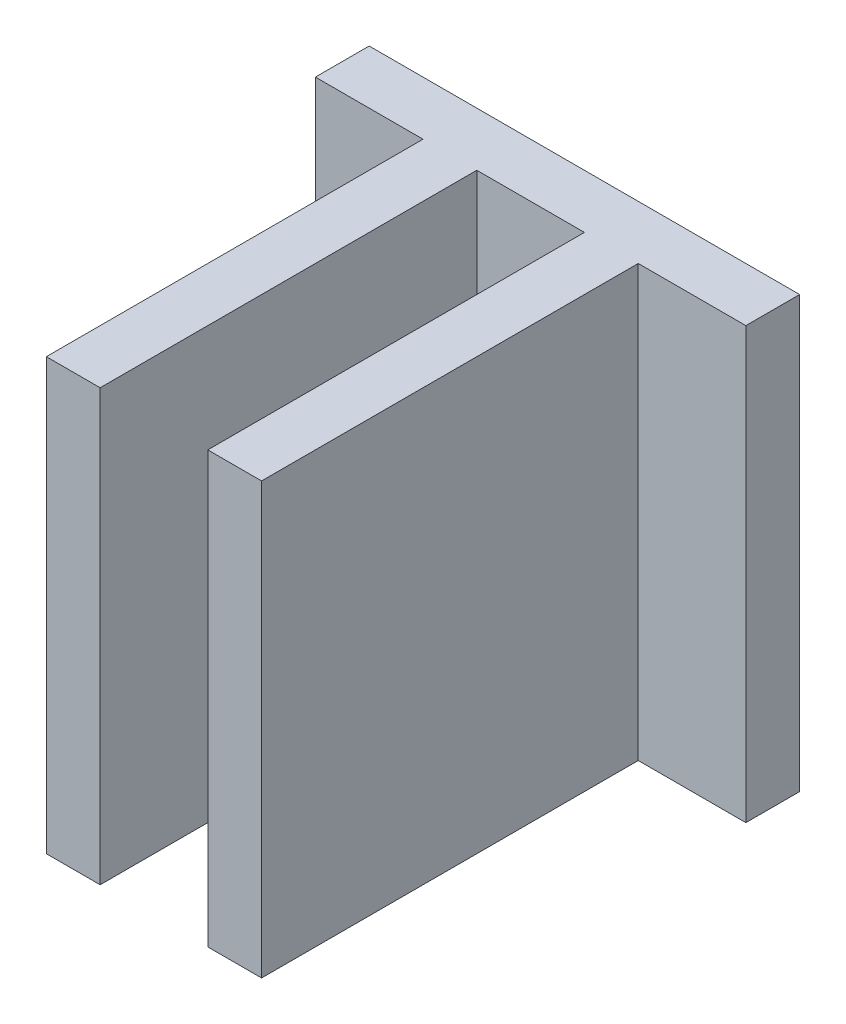
ISO-10303-21;
HEADER;
FILE_DESCRIPTION(('STEP AP214'),'2;1');
FILE_NAME('part.step','',(''),(''),'','','');
FILE_SCHEMA(('AUTOMOTIVE_DESIGN { 1 0 10303 214 1 1 1 1 }'));
ENDSEC;
DATA;
#1=APPLICATION_CONTEXT('core data for automotive mechanical design processes');
#2=APPLICATION_PROTOCOL_DEFINITION('international standard','automotive_design',2000,#1);
#3=PRODUCT_CONTEXT('',#1,'mechanical');
#4=PRODUCT('Part','Part','',(#3));
#5=PRODUCT_RELATED_PRODUCT_CATEGORY('part','',(#4));
#6=PRODUCT_DEFINITION_FORMATION('','',#4);
#7=PRODUCT_DEFINITION_CONTEXT('part definition',#1,'design');
#8=PRODUCT_DEFINITION('design','',#6,#7);
#9=PRODUCT_DEFINITION_SHAPE('','',#8);
#10=(LENGTH_UNIT() NAMED_UNIT(*) SI_UNIT(.MILLI.,.METRE.));
#11=(NAMED_UNIT(*) PLANE_ANGLE_UNIT() SI_UNIT($,.RADIAN.));
#12=(NAMED_UNIT(*) SI_UNIT($,.STERADIAN.) SOLID_ANGLE_UNIT());
#13=UNCERTAINTY_MEASURE_WITH_UNIT(LENGTH_MEASURE(1.E-05),#10,'distance_accuracy_value','');
#14=(GEOMETRIC_REPRESENTATION_CONTEXT(3) GLOBAL_UNCERTAINTY_ASSIGNED_CONTEXT((#13)) GLOBAL_UNIT_ASSIGNED_CONTEXT((#10,
#11,#12)) REPRESENTATION_CONTEXT('',''));
#15=CARTESIAN_POINT('',(0.,0.,0.));
#16=DIRECTION('',(0.,0.,1.));
#17=DIRECTION('',(1.,0.,0.));
#18=AXIS2_PLACEMENT_3D('',#15,#16,#17);
#19=CARTESIAN_POINT('',(0.,25.4,3.175));
#20=DIRECTION('',(1.,0.,0.));
#21=DIRECTION('',(0.,0.,-1.));
#22=AXIS2_PLACEMENT_3D('',#19,#20,#21);
#23=PLANE('',#22);
#24=DIRECTION('',(0.,0.,1.));
#25=VECTOR('',#24,1.);
#26=CARTESIAN_POINT('',(0.,0.,3.175));
#27=LINE('',#26,#25);
#28=CARTESIAN_POINT('',(0.,0.,0.));
#29=VERTEX_POINT('',#28);
#30=CARTESIAN_POINT('',(0.,0.,3.175));
#31=VERTEX_POINT('',#30);
#32=EDGE_CURVE('E153',#29,#31,#27,.T.);
#33=ORIENTED_EDGE('',*,*,#32,.T.);
#34=DIRECTION('',(0.,-1.,0.));
#35=VECTOR('',#34,1.);
#36=CARTESIAN_POINT('',(0.,25.4,3.175));
#37=LINE('',#36,#35);
#38=CARTESIAN_POINT('',(0.,25.4,3.175));
#39=VERTEX_POINT('',#38);
#40=EDGE_CURVE('E11',#39,#31,#37,.T.);
#41=ORIENTED_EDGE('',*,*,#40,.F.);
#42=DIRECTION('',(0.,0.,1.));
#43=VECTOR('',#42,1.);
#44=CARTESIAN_POINT('',(0.,25.4,3.175));
#45=LINE('',#44,#43);
#46=CARTESIAN_POINT('',(0.,25.4,0.));
#47=VERTEX_POINT('',#46);
#48=EDGE_CURVE('E175',#47,#39,#45,.T.);
#49=ORIENTED_EDGE('',*,*,#48,.F.);
#50=DIRECTION('',(0.,-1.,0.));
#51=VECTOR('',#50,1.);
#52=CARTESIAN_POINT('',(0.,25.4,0.));
#53=LINE('',#52,#51);
#54=EDGE_CURVE('E149',#47,#29,#53,.T.);
#55=ORIENTED_EDGE('',*,*,#54,.T.);
#56=EDGE_LOOP('',(#33,#41,#49,#55));
#57=FACE_BOUND('',#56,.T.);
#58=ADVANCED_FACE('F33',(#57),#23,.F.);
#59=CARTESIAN_POINT('',(6.35,25.4,3.175));
#60=DIRECTION('',(0.,0.,-1.));
#61=DIRECTION('',(-1.,0.,0.));
#62=AXIS2_PLACEMENT_3D('',#59,#60,#61);
#63=PLANE('',#62);
#64=DIRECTION('',(1.,0.,0.));
#65=VECTOR('',#64,1.);
#66=CARTESIAN_POINT('',(6.35,0.,3.175));
#67=LINE('',#66,#65);
#68=CARTESIAN_POINT('',(6.35,0.,3.175));
#69=VERTEX_POINT('',#68);
#70=EDGE_CURVE('E156',#31,#69,#67,.T.);
#71=ORIENTED_EDGE('',*,*,#70,.T.);
#72=DIRECTION('',(0.,-1.,0.));
#73=VECTOR('',#72,1.);
#74=CARTESIAN_POINT('',(6.35,25.4,3.175));
#75=LINE('',#74,#73);
#76=CARTESIAN_POINT('',(6.35,25.4,3.175));
#77=VERTEX_POINT('',#76);
#78=EDGE_CURVE('E41',#77,#69,#75,.T.);
#79=ORIENTED_EDGE('',*,*,#78,.F.);
#80=DIRECTION('',(1.,0.,0.));
#81=VECTOR('',#80,1.);
#82=CARTESIAN_POINT('',(6.35,25.4,3.175));
#83=LINE('',#82,#81);
#84=EDGE_CURVE('E104',#39,#77,#83,.T.);
#85=ORIENTED_EDGE('',*,*,#84,.F.);
#86=ORIENTED_EDGE('',*,*,#40,.T.);
#87=EDGE_LOOP('',(#71,#79,#85,#86));
#88=FACE_BOUND('',#87,.T.);
#89=ADVANCED_FACE('F253',(#88),#63,.F.);
#90=CARTESIAN_POINT('',(6.35,25.4,25.4));
#91=DIRECTION('',(1.,0.,0.));
#92=DIRECTION('',(0.,0.,-1.));
#93=AXIS2_PLACEMENT_3D('',#90,#91,#92);
#94=PLANE('',#93);
#95=DIRECTION('',(0.,0.,1.));
#96=VECTOR('',#95,1.);
#97=CARTESIAN_POINT('',(6.35,0.,25.4));
#98=LINE('',#97,#96);
#99=CARTESIAN_POINT('',(6.35,0.,25.4));
#100=VERTEX_POINT('',#99);
#101=EDGE_CURVE('E158',#69,#100,#98,.T.);
#102=ORIENTED_EDGE('',*,*,#101,.T.);
#103=DIRECTION('',(0.,-1.,0.));
#104=VECTOR('',#103,1.);
#105=CARTESIAN_POINT('',(6.35,25.4,25.4));
#106=LINE('',#105,#104);
#107=CARTESIAN_POINT('',(6.35,25.4,25.4));
#108=VERTEX_POINT('',#107);
#109=EDGE_CURVE('E194',#108,#100,#106,.T.);
#110=ORIENTED_EDGE('',*,*,#109,.F.);
#111=DIRECTION('',(0.,0.,1.));
#112=VECTOR('',#111,1.);
#113=CARTESIAN_POINT('',(6.35,25.4,25.4));
#114=LINE('',#113,#112);
#115=EDGE_CURVE('E202',#77,#108,#114,.T.);
#116=ORIENTED_EDGE('',*,*,#115,.F.);
#117=ORIENTED_EDGE('',*,*,#78,.T.);
#118=EDGE_LOOP('',(#102,#110,#116,#117));
#119=FACE_BOUND('',#118,.T.);
#120=ADVANCED_FACE('F200',(#119),#94,.F.);
#121=CARTESIAN_POINT('',(9.525,25.4,25.4));
#122=DIRECTION('',(0.,0.,-1.));
#123=DIRECTION('',(-1.,0.,0.));
#124=AXIS2_PLACEMENT_3D('',#121,#122,#123);
#125=PLANE('',#124);
#126=DIRECTION('',(1.,0.,0.));
#127=VECTOR('',#126,1.);
#128=CARTESIAN_POINT('',(9.525,0.,25.4));
#129=LINE('',#128,#127);
#130=CARTESIAN_POINT('',(9.525,0.,25.4));
#131=VERTEX_POINT('',#130);
#132=EDGE_CURVE('E160',#100,#131,#129,.T.);
#133=ORIENTED_EDGE('',*,*,#132,.T.);
#134=DIRECTION('',(0.,-1.,0.));
#135=VECTOR('',#134,1.);
#136=CARTESIAN_POINT('',(9.525,25.4,25.4));
#137=LINE('',#136,#135);
#138=CARTESIAN_POINT('',(9.525,25.4,25.4));
#139=VERTEX_POINT('',#138);
#140=EDGE_CURVE('E191',#139,#131,#137,.T.);
#141=ORIENTED_EDGE('',*,*,#140,.F.);
#142=DIRECTION('',(1.,0.,0.));
#143=VECTOR('',#142,1.);
#144=CARTESIAN_POINT('',(9.525,25.4,25.4));
#145=LINE('',#144,#143);
#146=EDGE_CURVE('E220',#108,#139,#145,.T.);
#147=ORIENTED_EDGE('',*,*,#146,.F.);
#148=ORIENTED_EDGE('',*,*,#109,.T.);
#149=EDGE_LOOP('',(#133,#141,#147,#148));
#150=FACE_BOUND('',#149,.T.);
#151=ADVANCED_FACE('F211',(#150),#125,.F.);
#152=CARTESIAN_POINT('',(9.525,25.4,3.175));
#153=DIRECTION('',(-1.,0.,0.));
#154=DIRECTION('',(0.,0.,1.));
#155=AXIS2_PLACEMENT_3D('',#152,#153,#154);
#156=PLANE('',#155);
#157=DIRECTION('',(0.,0.,-1.));
#158=VECTOR('',#157,1.);
#159=CARTESIAN_POINT('',(9.525,0.,3.175));
#160=LINE('',#159,#158);
#161=CARTESIAN_POINT('',(9.525,0.,3.175));
#162=VERTEX_POINT('',#161);
#163=EDGE_CURVE('E162',#131,#162,#160,.T.);
#164=ORIENTED_EDGE('',*,*,#163,.T.);
#165=DIRECTION('',(0.,-1.,0.));
#166=VECTOR('',#165,1.);
#167=CARTESIAN_POINT('',(9.525,25.4,3.175));
#168=LINE('',#167,#166);
#169=CARTESIAN_POINT('',(9.525,25.4,3.175));
#170=VERTEX_POINT('',#169);
#171=EDGE_CURVE('E188',#170,#162,#168,.T.);
#172=ORIENTED_EDGE('',*,*,#171,.F.);
#173=DIRECTION('',(0.,0.,-1.));
#174=VECTOR('',#173,1.);
#175=CARTESIAN_POINT('',(9.525,25.4,3.175));
#176=LINE('',#175,#174);
#177=EDGE_CURVE('E217',#139,#170,#176,.T.);
#178=ORIENTED_EDGE('',*,*,#177,.F.);
#179=ORIENTED_EDGE('',*,*,#140,.T.);
#180=EDGE_LOOP('',(#164,#172,#178,#179));
#181=FACE_BOUND('',#180,.T.);
#182=ADVANCED_FACE('F215',(#181),#156,.F.);
#183=CARTESIAN_POINT('',(15.875,25.4,3.175));
#184=DIRECTION('',(0.,0.,-1.));
#185=DIRECTION('',(-1.,0.,0.));
#186=AXIS2_PLACEMENT_3D('',#183,#184,#185);
#187=PLANE('',#186);
#188=DIRECTION('',(1.,0.,0.));
#189=VECTOR('',#188,1.);
#190=CARTESIAN_POINT('',(15.875,0.,3.175));
#191=LINE('',#190,#189);
#192=CARTESIAN_POINT('',(15.875,0.,3.175));
#193=VERTEX_POINT('',#192);
#194=EDGE_CURVE('E164',#162,#193,#191,.T.);
#195=ORIENTED_EDGE('',*,*,#194,.T.);
#196=DIRECTION('',(0.,-1.,0.));
#197=VECTOR('',#196,1.);
#198=CARTESIAN_POINT('',(15.875,25.4,3.175));
#199=LINE('',#198,#197);
#200=CARTESIAN_POINT('',(15.875,25.4,3.175));
#201=VERTEX_POINT('',#200);
#202=EDGE_CURVE('E185',#201,#193,#199,.T.);
#203=ORIENTED_EDGE('',*,*,#202,.F.);
#204=DIRECTION('',(1.,0.,0.));
#205=VECTOR('',#204,1.);
#206=CARTESIAN_POINT('',(15.875,25.4,3.175));
#207=LINE('',#206,#205);
#208=EDGE_CURVE('E219',#170,#201,#207,.T.);
#209=ORIENTED_EDGE('',*,*,#208,.F.);
#210=ORIENTED_EDGE('',*,*,#171,.T.);
#211=EDGE_LOOP('',(#195,#203,#209,#210));
#212=FACE_BOUND('',#211,.T.);
#213=ADVANCED_FACE('F266',(#212),#187,.F.);
#214=CARTESIAN_POINT('',(15.875,25.4,25.4));
#215=DIRECTION('',(1.,0.,0.));
#216=DIRECTION('',(0.,0.,-1.));
#217=AXIS2_PLACEMENT_3D('',#214,#215,#216);
#218=PLANE('',#217);
#219=DIRECTION('',(0.,0.,1.));
#220=VECTOR('',#219,1.);
#221=CARTESIAN_POINT('',(15.875,0.,25.4));
#222=LINE('',#221,#220);
#223=CARTESIAN_POINT('',(15.875,0.,25.4));
#224=VERTEX_POINT('',#223);
#225=EDGE_CURVE('E166',#193,#224,#222,.T.);
#226=ORIENTED_EDGE('',*,*,#225,.T.);
#227=DIRECTION('',(0.,-1.,0.));
#228=VECTOR('',#227,1.);
#229=CARTESIAN_POINT('',(15.875,25.4,25.4));
#230=LINE('',#229,#228);
#231=CARTESIAN_POINT('',(15.875,25.4,25.4));
#232=VERTEX_POINT('',#231);
#233=EDGE_CURVE('E182',#232,#224,#230,.T.);
#234=ORIENTED_EDGE('',*,*,#233,.F.);
#235=DIRECTION('',(0.,0.,1.));
#236=VECTOR('',#235,1.);
#237=CARTESIAN_POINT('',(15.875,25.4,25.4));
#238=LINE('',#237,#236);
#239=EDGE_CURVE('E222',#201,#232,#238,.T.);
#240=ORIENTED_EDGE('',*,*,#239,.F.);
#241=ORIENTED_EDGE('',*,*,#202,.T.);
#242=EDGE_LOOP('',(#226,#234,#240,#241));
#243=FACE_BOUND('',#242,.T.);
#244=ADVANCED_FACE('F269',(#243),#218,.F.);
#245=CARTESIAN_POINT('',(19.05,25.4,25.4));
#246=DIRECTION('',(0.,0.,-1.));
#247=DIRECTION('',(-1.,0.,0.));
#248=AXIS2_PLACEMENT_3D('',#245,#246,#247);
#249=PLANE('',#248);
#250=DIRECTION('',(1.,0.,0.));
#251=VECTOR('',#250,1.);
#252=CARTESIAN_POINT('',(19.05,0.,25.4));
#253=LINE('',#252,#251);
#254=CARTESIAN_POINT('',(19.05,0.,25.4));
#255=VERTEX_POINT('',#254);
#256=EDGE_CURVE('E168',#224,#255,#253,.T.);
#257=ORIENTED_EDGE('',*,*,#256,.T.);
#258=DIRECTION('',(0.,-1.,0.));
#259=VECTOR('',#258,1.);
#260=CARTESIAN_POINT('',(19.05,25.4,25.4));
#261=LINE('',#260,#259);
#262=CARTESIAN_POINT('',(19.05,25.4,25.4));
#263=VERTEX_POINT('',#262);
#264=EDGE_CURVE('E179',#263,#255,#261,.T.);
#265=ORIENTED_EDGE('',*,*,#264,.F.);
#266=DIRECTION('',(1.,0.,0.));
#267=VECTOR('',#266,1.);
#268=CARTESIAN_POINT('',(19.05,25.4,25.4));
#269=LINE('',#268,#267);
#270=EDGE_CURVE('E228',#232,#263,#269,.T.);
#271=ORIENTED_EDGE('',*,*,#270,.F.);
#272=ORIENTED_EDGE('',*,*,#233,.T.);
#273=EDGE_LOOP('',(#257,#265,#271,#272));
#274=FACE_BOUND('',#273,.T.);
#275=ADVANCED_FACE('F234',(#274),#249,.F.);
#276=CARTESIAN_POINT('',(19.05,25.4,3.175));
#277=DIRECTION('',(-1.,0.,0.));
#278=DIRECTION('',(0.,0.,1.));
#279=AXIS2_PLACEMENT_3D('',#276,#277,#278);
#280=PLANE('',#279);
#281=DIRECTION('',(0.,0.,-1.));
#282=VECTOR('',#281,1.);
#283=CARTESIAN_POINT('',(19.05,0.,3.175));
#284=LINE('',#283,#282);
#285=CARTESIAN_POINT('',(19.05,0.,3.175));
#286=VERTEX_POINT('',#285);
#287=EDGE_CURVE('E170',#255,#286,#284,.T.);
#288=ORIENTED_EDGE('',*,*,#287,.T.);
#289=DIRECTION('',(0.,-1.,0.));
#290=VECTOR('',#289,1.);
#291=CARTESIAN_POINT('',(19.05,25.4,3.175));
#292=LINE('',#291,#290);
#293=CARTESIAN_POINT('',(19.05,25.4,3.175));
#294=VERTEX_POINT('',#293);
#295=EDGE_CURVE('E144',#294,#286,#292,.T.);
#296=ORIENTED_EDGE('',*,*,#295,.F.);
#297=DIRECTION('',(0.,0.,-1.));
#298=VECTOR('',#297,1.);
#299=CARTESIAN_POINT('',(19.05,25.4,3.175));
#300=LINE('',#299,#298);
#301=EDGE_CURVE('E135',#263,#294,#300,.T.);
#302=ORIENTED_EDGE('',*,*,#301,.F.);
#303=ORIENTED_EDGE('',*,*,#264,.T.);
#304=EDGE_LOOP('',(#288,#296,#302,#303));
#305=FACE_BOUND('',#304,.T.);
#306=ADVANCED_FACE('F238',(#305),#280,.F.);
#307=CARTESIAN_POINT('',(25.4,25.4,3.175));
#308=DIRECTION('',(0.,0.,-1.));
#309=DIRECTION('',(-1.,0.,0.));
#310=AXIS2_PLACEMENT_3D('',#307,#308,#309);
#311=PLANE('',#310);
#312=DIRECTION('',(1.,0.,0.));
#313=VECTOR('',#312,1.);
#314=CARTESIAN_POINT('',(25.4,0.,3.175));
#315=LINE('',#314,#313);
#316=CARTESIAN_POINT('',(25.4,0.,3.175));
#317=VERTEX_POINT('',#316);
#318=EDGE_CURVE('E143',#286,#317,#315,.T.);
#319=ORIENTED_EDGE('',*,*,#318,.T.);
#320=DIRECTION('',(0.,-1.,0.));
#321=VECTOR('',#320,1.);
#322=CARTESIAN_POINT('',(25.4,25.4,3.175));
#323=LINE('',#322,#321);
#324=CARTESIAN_POINT('',(25.4,25.4,3.175));
#325=VERTEX_POINT('',#324);
#326=EDGE_CURVE('E140',#325,#317,#323,.T.);
#327=ORIENTED_EDGE('',*,*,#326,.F.);
#328=DIRECTION('',(1.,0.,0.));
#329=VECTOR('',#328,1.);
#330=CARTESIAN_POINT('',(25.4,25.4,3.175));
#331=LINE('',#330,#329);
#332=EDGE_CURVE('E129',#294,#325,#331,.T.);
#333=ORIENTED_EDGE('',*,*,#332,.F.);
#334=ORIENTED_EDGE('',*,*,#295,.T.);
#335=EDGE_LOOP('',(#319,#327,#333,#334));
#336=FACE_BOUND('',#335,.T.);
#337=ADVANCED_FACE('F141',(#336),#311,.F.);
#338=CARTESIAN_POINT('',(25.4,25.4,0.));
#339=DIRECTION('',(-1.,0.,0.));
#340=DIRECTION('',(0.,0.,1.));
#341=AXIS2_PLACEMENT_3D('',#338,#339,#340);
#342=PLANE('',#341);
#343=DIRECTION('',(0.,0.,-1.));
#344=VECTOR('',#343,1.);
#345=CARTESIAN_POINT('',(25.4,0.,0.));
#346=LINE('',#345,#344);
#347=CARTESIAN_POINT('',(25.4,0.,0.));
#348=VERTEX_POINT('',#347);
#349=EDGE_CURVE('E90',#317,#348,#346,.T.);
#350=ORIENTED_EDGE('',*,*,#349,.T.);
#351=DIRECTION('',(0.,-1.,0.));
#352=VECTOR('',#351,1.);
#353=CARTESIAN_POINT('',(25.4,25.4,0.));
#354=LINE('',#353,#352);
#355=CARTESIAN_POINT('',(25.4,25.4,0.));
#356=VERTEX_POINT('',#355);
#357=EDGE_CURVE('E145',#356,#348,#354,.T.);
#358=ORIENTED_EDGE('',*,*,#357,.F.);
#359=DIRECTION('',(0.,0.,-1.));
#360=VECTOR('',#359,1.);
#361=CARTESIAN_POINT('',(25.4,25.4,0.));
#362=LINE('',#361,#360);
#363=EDGE_CURVE('E133',#325,#356,#362,.T.);
#364=ORIENTED_EDGE('',*,*,#363,.F.);
#365=ORIENTED_EDGE('',*,*,#326,.T.);
#366=EDGE_LOOP('',(#350,#358,#364,#365));
#367=FACE_BOUND('',#366,.T.);
#368=ADVANCED_FACE('F147',(#367),#342,.F.);
#369=CARTESIAN_POINT('',(0.,25.4,0.));
#370=DIRECTION('',(0.,0.,1.));
#371=DIRECTION('',(1.,0.,0.));
#372=AXIS2_PLACEMENT_3D('',#369,#370,#371);
#373=PLANE('',#372);
#374=DIRECTION('',(-1.,0.,0.));
#375=VECTOR('',#374,1.);
#376=CARTESIAN_POINT('',(0.,0.,0.));
#377=LINE('',#376,#375);
#378=EDGE_CURVE('E96',#348,#29,#377,.T.);
#379=ORIENTED_EDGE('',*,*,#378,.T.);
#380=ORIENTED_EDGE('',*,*,#54,.F.);
#381=DIRECTION('',(-1.,0.,0.));
#382=VECTOR('',#381,1.);
#383=CARTESIAN_POINT('',(0.,25.4,0.));
#384=LINE('',#383,#382);
#385=EDGE_CURVE('E49',#356,#47,#384,.T.);
#386=ORIENTED_EDGE('',*,*,#385,.F.);
#387=ORIENTED_EDGE('',*,*,#357,.T.);
#388=EDGE_LOOP('',(#379,#380,#386,#387));
#389=FACE_BOUND('',#388,.T.);
#390=ADVANCED_FACE('F242',(#389),#373,.F.);
#391=CARTESIAN_POINT('',(0.,25.4,0.));
#392=DIRECTION('',(0.,-1.,0.));
#393=DIRECTION('',(0.,0.,-1.));
#394=AXIS2_PLACEMENT_3D('',#391,#392,#393);
#395=PLANE('',#394);
#396=ORIENTED_EDGE('',*,*,#48,.T.);
#397=ORIENTED_EDGE('',*,*,#84,.T.);
#398=ORIENTED_EDGE('',*,*,#115,.T.);
#399=ORIENTED_EDGE('',*,*,#146,.T.);
#400=ORIENTED_EDGE('',*,*,#177,.T.);
#401=ORIENTED_EDGE('',*,*,#208,.T.);
#402=ORIENTED_EDGE('',*,*,#239,.T.);
#403=ORIENTED_EDGE('',*,*,#270,.T.);
#404=ORIENTED_EDGE('',*,*,#301,.T.);
#405=ORIENTED_EDGE('',*,*,#332,.T.);
#406=ORIENTED_EDGE('',*,*,#363,.T.);
#407=ORIENTED_EDGE('',*,*,#385,.T.);
#408=EDGE_LOOP('',(#396,#397,#398,#399,#400,#401,#402,#403,#404,#405,#406,#407));
#409=FACE_BOUND('',#408,.T.);
#410=ADVANCED_FACE('F131',(#409),#395,.F.);
#411=CARTESIAN_POINT('',(0.,0.,0.));
#412=DIRECTION('',(0.,-1.,0.));
#413=DIRECTION('',(0.,0.,-1.));
#414=AXIS2_PLACEMENT_3D('',#411,#412,#413);
#415=PLANE('',#414);
#416=ORIENTED_EDGE('',*,*,#32,.F.);
#417=ORIENTED_EDGE('',*,*,#378,.F.);
#418=ORIENTED_EDGE('',*,*,#349,.F.);
#419=ORIENTED_EDGE('',*,*,#318,.F.);
#420=ORIENTED_EDGE('',*,*,#287,.F.);
#421=ORIENTED_EDGE('',*,*,#256,.F.);
#422=ORIENTED_EDGE('',*,*,#225,.F.);
#423=ORIENTED_EDGE('',*,*,#194,.F.);
#424=ORIENTED_EDGE('',*,*,#163,.F.);
#425=ORIENTED_EDGE('',*,*,#132,.F.);
#426=ORIENTED_EDGE('',*,*,#101,.F.);
#427=ORIENTED_EDGE('',*,*,#70,.F.);
#428=EDGE_LOOP('',(#416,#417,#418,#419,#420,#421,#422,#423,#424,#425,#426,#427));
#429=FACE_BOUND('',#428,.T.);
#430=ADVANCED_FACE('F206',(#429),#415,.T.);
#431=CLOSED_SHELL('',(#58,#89,#120,#151,#182,#213,#244,#275,#306,#337,#368,#390,#410,#430));
#432=MANIFOLD_SOLID_BREP('B2',#431);
#433=ADVANCED_BREP_SHAPE_REPRESENTATION('',(#18,#432),#14);
#434=SHAPE_DEFINITION_REPRESENTATION(#9,#433);
ENDSEC;
END-ISO-10303-21;
